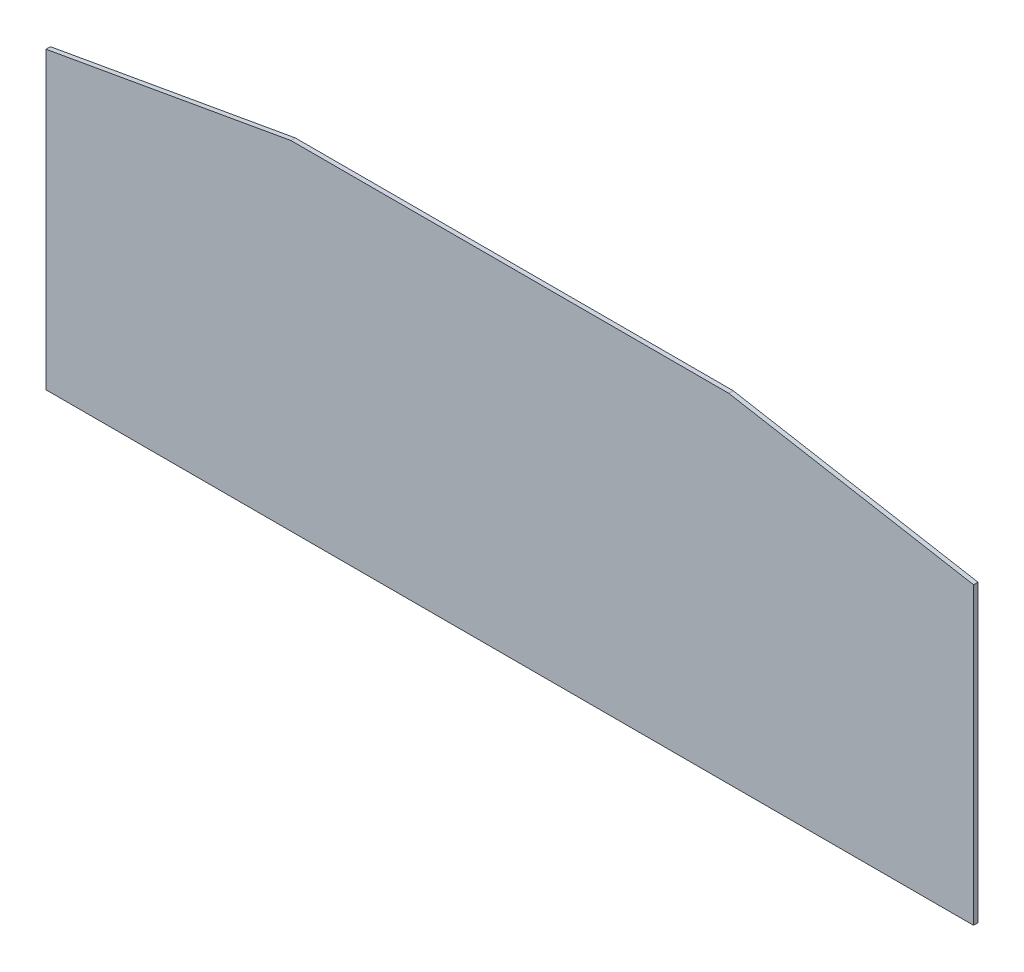
ISO-10303-21;
HEADER;
FILE_DESCRIPTION(('STEP AP214'),'2;1');
FILE_NAME('part.step','',(''),(''),'','','');
FILE_SCHEMA(('AUTOMOTIVE_DESIGN { 1 0 10303 214 1 1 1 1 }'));
ENDSEC;
DATA;
#1=APPLICATION_CONTEXT('core data for automotive mechanical design processes');
#2=APPLICATION_PROTOCOL_DEFINITION('international standard','automotive_design',2000,#1);
#3=PRODUCT_CONTEXT('',#1,'mechanical');
#4=PRODUCT('Part','Part','',(#3));
#5=PRODUCT_RELATED_PRODUCT_CATEGORY('part','',(#4));
#6=PRODUCT_DEFINITION_FORMATION('','',#4);
#7=PRODUCT_DEFINITION_CONTEXT('part definition',#1,'design');
#8=PRODUCT_DEFINITION('design','',#6,#7);
#9=PRODUCT_DEFINITION_SHAPE('','',#8);
#10=(LENGTH_UNIT() NAMED_UNIT(*) SI_UNIT(.MILLI.,.METRE.));
#11=(NAMED_UNIT(*) PLANE_ANGLE_UNIT() SI_UNIT($,.RADIAN.));
#12=(NAMED_UNIT(*) SI_UNIT($,.STERADIAN.) SOLID_ANGLE_UNIT());
#13=UNCERTAINTY_MEASURE_WITH_UNIT(LENGTH_MEASURE(1.E-05),#10,'distance_accuracy_value','');
#14=(GEOMETRIC_REPRESENTATION_CONTEXT(3) GLOBAL_UNCERTAINTY_ASSIGNED_CONTEXT((#13)) GLOBAL_UNIT_ASSIGNED_CONTEXT((#10,
#11,#12)) REPRESENTATION_CONTEXT('',''));
#15=CARTESIAN_POINT('',(0.,0.,0.));
#16=DIRECTION('',(0.,0.,1.));
#17=DIRECTION('',(1.,0.,0.));
#18=AXIS2_PLACEMENT_3D('',#15,#16,#17);
#19=CARTESIAN_POINT('',(2500.,-3.82820902550103E-13,-12.));
#20=DIRECTION('',(0.,-1.,0.));
#21=DIRECTION('',(1.,0.,0.));
#22=AXIS2_PLACEMENT_3D('',#19,#20,#21);
#23=PLANE('',#22);
#24=DIRECTION('',(1.,0.,0.));
#25=VECTOR('',#24,1.);
#26=CARTESIAN_POINT('',(2500.,-3.82820902550103E-13,0.));
#27=LINE('',#26,#25);
#28=CARTESIAN_POINT('',(0.,0.,0.));
#29=VERTEX_POINT('',#28);
#30=CARTESIAN_POINT('',(2500.,-3.82820902550103E-13,0.));
#31=VERTEX_POINT('',#30);
#32=EDGE_CURVE('E125',#29,#31,#27,.T.);
#33=ORIENTED_EDGE('',*,*,#32,.F.);
#34=DIRECTION('',(0.,0.,1.));
#35=VECTOR('',#34,1.);
#36=CARTESIAN_POINT('',(0.,0.,-12.));
#37=LINE('',#36,#35);
#38=CARTESIAN_POINT('',(0.,0.,-12.));
#39=VERTEX_POINT('',#38);
#40=EDGE_CURVE('E11',#39,#29,#37,.T.);
#41=ORIENTED_EDGE('',*,*,#40,.F.);
#42=DIRECTION('',(1.,0.,0.));
#43=VECTOR('',#42,1.);
#44=CARTESIAN_POINT('',(2500.,-3.82820902550103E-13,-12.));
#45=LINE('',#44,#43);
#46=CARTESIAN_POINT('',(2500.,-3.82820902550103E-13,-12.));
#47=VERTEX_POINT('',#46);
#48=EDGE_CURVE('E139',#39,#47,#45,.T.);
#49=ORIENTED_EDGE('',*,*,#48,.T.);
#50=DIRECTION('',(0.,0.,1.));
#51=VECTOR('',#50,1.);
#52=CARTESIAN_POINT('',(2500.,-3.82820902550103E-13,-12.));
#53=LINE('',#52,#51);
#54=EDGE_CURVE('E43',#47,#31,#53,.T.);
#55=ORIENTED_EDGE('',*,*,#54,.T.);
#56=EDGE_LOOP('',(#33,#41,#49,#55));
#57=FACE_BOUND('',#56,.T.);
#58=ADVANCED_FACE('F40',(#57),#23,.T.);
#59=CARTESIAN_POINT('',(0.,0.,-12.));
#60=DIRECTION('',(-1.,0.,0.));
#61=DIRECTION('',(0.,0.,1.));
#62=AXIS2_PLACEMENT_3D('',#59,#60,#61);
#63=PLANE('',#62);
#64=DIRECTION('',(0.,-1.,0.));
#65=VECTOR('',#64,1.);
#66=CARTESIAN_POINT('',(0.,0.,0.));
#67=LINE('',#66,#65);
#68=CARTESIAN_POINT('',(0.,795.,0.));
#69=VERTEX_POINT('',#68);
#70=EDGE_CURVE('E137',#69,#29,#67,.T.);
#71=ORIENTED_EDGE('',*,*,#70,.F.);
#72=DIRECTION('',(0.,0.,1.));
#73=VECTOR('',#72,1.);
#74=CARTESIAN_POINT('',(0.,795.,-12.));
#75=LINE('',#74,#73);
#76=CARTESIAN_POINT('',(0.,795.,-12.));
#77=VERTEX_POINT('',#76);
#78=EDGE_CURVE('E49',#77,#69,#75,.T.);
#79=ORIENTED_EDGE('',*,*,#78,.F.);
#80=DIRECTION('',(0.,-1.,0.));
#81=VECTOR('',#80,1.);
#82=CARTESIAN_POINT('',(0.,0.,-12.));
#83=LINE('',#82,#81);
#84=EDGE_CURVE('E115',#77,#39,#83,.T.);
#85=ORIENTED_EDGE('',*,*,#84,.T.);
#86=ORIENTED_EDGE('',*,*,#40,.T.);
#87=EDGE_LOOP('',(#71,#79,#85,#86));
#88=FACE_BOUND('',#87,.T.);
#89=ADVANCED_FACE('F147',(#88),#63,.T.);
#90=CARTESIAN_POINT('',(0.,795.,-12.));
#91=DIRECTION('',(-0.174551252246048,0.984648089593097,0.));
#92=DIRECTION('',(-0.984648089593098,-0.174551252246048,0.));
#93=AXIS2_PLACEMENT_3D('',#90,#91,#92);
#94=PLANE('',#93);
#95=DIRECTION('',(-0.984648089593098,-0.174551252246048,0.));
#96=VECTOR('',#95,1.);
#97=CARTESIAN_POINT('',(0.,795.,0.));
#98=LINE('',#97,#96);
#99=CARTESIAN_POINT('',(660.,911.999999999999,0.));
#100=VERTEX_POINT('',#99);
#101=EDGE_CURVE('E102',#100,#69,#98,.T.);
#102=ORIENTED_EDGE('',*,*,#101,.F.);
#103=DIRECTION('',(0.,0.,1.));
#104=VECTOR('',#103,1.);
#105=CARTESIAN_POINT('',(660.,911.999999999999,-12.));
#106=LINE('',#105,#104);
#107=CARTESIAN_POINT('',(660.,911.999999999999,-12.));
#108=VERTEX_POINT('',#107);
#109=EDGE_CURVE('E97',#108,#100,#106,.T.);
#110=ORIENTED_EDGE('',*,*,#109,.F.);
#111=DIRECTION('',(-0.984648089593098,-0.174551252246048,0.));
#112=VECTOR('',#111,1.);
#113=CARTESIAN_POINT('',(0.,795.,-12.));
#114=LINE('',#113,#112);
#115=EDGE_CURVE('E100',#108,#77,#114,.T.);
#116=ORIENTED_EDGE('',*,*,#115,.T.);
#117=ORIENTED_EDGE('',*,*,#78,.T.);
#118=EDGE_LOOP('',(#102,#110,#116,#117));
#119=FACE_BOUND('',#118,.T.);
#120=ADVANCED_FACE('F99',(#119),#94,.T.);
#121=CARTESIAN_POINT('',(660.,911.999999999999,-12.));
#122=DIRECTION('',(0.,1.,0.));
#123=DIRECTION('',(-1.,0.,0.));
#124=AXIS2_PLACEMENT_3D('',#121,#122,#123);
#125=PLANE('',#124);
#126=DIRECTION('',(-1.,0.,0.));
#127=VECTOR('',#126,1.);
#128=CARTESIAN_POINT('',(660.,911.999999999999,0.));
#129=LINE('',#128,#127);
#130=CARTESIAN_POINT('',(1840.,911.999999999999,0.));
#131=VERTEX_POINT('',#130);
#132=EDGE_CURVE('E134',#131,#100,#129,.T.);
#133=ORIENTED_EDGE('',*,*,#132,.F.);
#134=DIRECTION('',(0.,0.,1.));
#135=VECTOR('',#134,1.);
#136=CARTESIAN_POINT('',(1840.,911.999999999999,-12.));
#137=LINE('',#136,#135);
#138=CARTESIAN_POINT('',(1840.,911.999999999999,-12.));
#139=VERTEX_POINT('',#138);
#140=EDGE_CURVE('E107',#139,#131,#137,.T.);
#141=ORIENTED_EDGE('',*,*,#140,.F.);
#142=DIRECTION('',(-1.,0.,0.));
#143=VECTOR('',#142,1.);
#144=CARTESIAN_POINT('',(660.,911.999999999999,-12.));
#145=LINE('',#144,#143);
#146=EDGE_CURVE('E113',#139,#108,#145,.T.);
#147=ORIENTED_EDGE('',*,*,#146,.T.);
#148=ORIENTED_EDGE('',*,*,#109,.T.);
#149=EDGE_LOOP('',(#133,#141,#147,#148));
#150=FACE_BOUND('',#149,.T.);
#151=ADVANCED_FACE('F117',(#150),#125,.T.);
#152=CARTESIAN_POINT('',(1840.,911.999999999999,-12.));
#153=DIRECTION('',(0.174551252246048,0.984648089593097,0.));
#154=DIRECTION('',(-0.984648089593098,0.174551252246048,0.));
#155=AXIS2_PLACEMENT_3D('',#152,#153,#154);
#156=PLANE('',#155);
#157=DIRECTION('',(-0.984648089593098,0.174551252246048,0.));
#158=VECTOR('',#157,1.);
#159=CARTESIAN_POINT('',(1840.,911.999999999999,0.));
#160=LINE('',#159,#158);
#161=CARTESIAN_POINT('',(2500.,795.,0.));
#162=VERTEX_POINT('',#161);
#163=EDGE_CURVE('E131',#162,#131,#160,.T.);
#164=ORIENTED_EDGE('',*,*,#163,.F.);
#165=DIRECTION('',(0.,0.,1.));
#166=VECTOR('',#165,1.);
#167=CARTESIAN_POINT('',(2500.,795.,-12.));
#168=LINE('',#167,#166);
#169=CARTESIAN_POINT('',(2500.,795.,-12.));
#170=VERTEX_POINT('',#169);
#171=EDGE_CURVE('E142',#170,#162,#168,.T.);
#172=ORIENTED_EDGE('',*,*,#171,.F.);
#173=DIRECTION('',(-0.984648089593098,0.174551252246048,0.));
#174=VECTOR('',#173,1.);
#175=CARTESIAN_POINT('',(1840.,911.999999999999,-12.));
#176=LINE('',#175,#174);
#177=EDGE_CURVE('E118',#170,#139,#176,.T.);
#178=ORIENTED_EDGE('',*,*,#177,.T.);
#179=ORIENTED_EDGE('',*,*,#140,.T.);
#180=EDGE_LOOP('',(#164,#172,#178,#179));
#181=FACE_BOUND('',#180,.T.);
#182=ADVANCED_FACE('F160',(#181),#156,.T.);
#183=CARTESIAN_POINT('',(2500.,795.,-12.));
#184=DIRECTION('',(1.,0.,0.));
#185=DIRECTION('',(0.,0.,-1.));
#186=AXIS2_PLACEMENT_3D('',#183,#184,#185);
#187=PLANE('',#186);
#188=DIRECTION('',(0.,1.,0.));
#189=VECTOR('',#188,1.);
#190=CARTESIAN_POINT('',(2500.,795.,0.));
#191=LINE('',#190,#189);
#192=EDGE_CURVE('E128',#31,#162,#191,.T.);
#193=ORIENTED_EDGE('',*,*,#192,.F.);
#194=ORIENTED_EDGE('',*,*,#54,.F.);
#195=DIRECTION('',(0.,1.,0.));
#196=VECTOR('',#195,1.);
#197=CARTESIAN_POINT('',(2500.,795.,-12.));
#198=LINE('',#197,#196);
#199=EDGE_CURVE('E120',#47,#170,#198,.T.);
#200=ORIENTED_EDGE('',*,*,#199,.T.);
#201=ORIENTED_EDGE('',*,*,#171,.T.);
#202=EDGE_LOOP('',(#193,#194,#200,#201));
#203=FACE_BOUND('',#202,.T.);
#204=ADVANCED_FACE('F144',(#203),#187,.T.);
#205=CARTESIAN_POINT('',(0.,0.,-12.));
#206=DIRECTION('',(0.,0.,-1.));
#207=DIRECTION('',(-1.,0.,0.));
#208=AXIS2_PLACEMENT_3D('',#205,#206,#207);
#209=PLANE('',#208);
#210=ORIENTED_EDGE('',*,*,#48,.F.);
#211=ORIENTED_EDGE('',*,*,#84,.F.);
#212=ORIENTED_EDGE('',*,*,#115,.F.);
#213=ORIENTED_EDGE('',*,*,#146,.F.);
#214=ORIENTED_EDGE('',*,*,#177,.F.);
#215=ORIENTED_EDGE('',*,*,#199,.F.);
#216=EDGE_LOOP('',(#210,#211,#212,#213,#214,#215));
#217=FACE_BOUND('',#216,.T.);
#218=ADVANCED_FACE('F111',(#217),#209,.T.);
#219=CARTESIAN_POINT('',(0.,0.,0.));
#220=DIRECTION('',(0.,0.,-1.));
#221=DIRECTION('',(-1.,0.,0.));
#222=AXIS2_PLACEMENT_3D('',#219,#220,#221);
#223=PLANE('',#222);
#224=ORIENTED_EDGE('',*,*,#32,.T.);
#225=ORIENTED_EDGE('',*,*,#192,.T.);
#226=ORIENTED_EDGE('',*,*,#163,.T.);
#227=ORIENTED_EDGE('',*,*,#132,.T.);
#228=ORIENTED_EDGE('',*,*,#101,.T.);
#229=ORIENTED_EDGE('',*,*,#70,.T.);
#230=EDGE_LOOP('',(#224,#225,#226,#227,#228,#229));
#231=FACE_BOUND('',#230,.T.);
#232=ADVANCED_FACE('F146',(#231),#223,.F.);
#233=CLOSED_SHELL('',(#58,#89,#120,#151,#182,#204,#218,#232));
#234=MANIFOLD_SOLID_BREP('B2',#233);
#235=ADVANCED_BREP_SHAPE_REPRESENTATION('',(#18,#234),#14);
#236=SHAPE_DEFINITION_REPRESENTATION(#9,#235);
ENDSEC;
END-ISO-10303-21;
